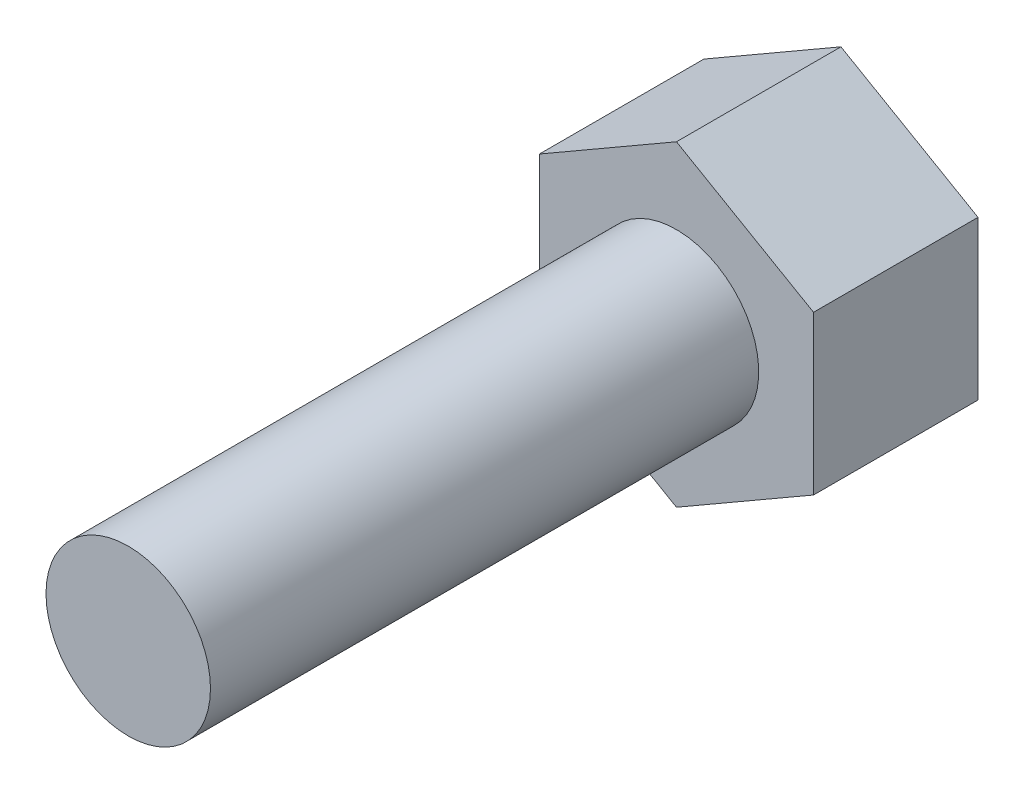
ISO-10303-21;
HEADER;
FILE_DESCRIPTION(('STEP AP214'),'2;1');
FILE_NAME('part.step','',(''),(''),'','','');
FILE_SCHEMA(('AUTOMOTIVE_DESIGN { 1 0 10303 214 1 1 1 1 }'));
ENDSEC;
DATA;
#1=APPLICATION_CONTEXT('core data for automotive mechanical design processes');
#2=APPLICATION_PROTOCOL_DEFINITION('international standard','automotive_design',2000,#1);
#3=PRODUCT_CONTEXT('',#1,'mechanical');
#4=PRODUCT('Part','Part','',(#3));
#5=PRODUCT_RELATED_PRODUCT_CATEGORY('part','',(#4));
#6=PRODUCT_DEFINITION_FORMATION('','',#4);
#7=PRODUCT_DEFINITION_CONTEXT('part definition',#1,'design');
#8=PRODUCT_DEFINITION('design','',#6,#7);
#9=PRODUCT_DEFINITION_SHAPE('','',#8);
#10=(LENGTH_UNIT() NAMED_UNIT(*) SI_UNIT(.MILLI.,.METRE.));
#11=(NAMED_UNIT(*) PLANE_ANGLE_UNIT() SI_UNIT($,.RADIAN.));
#12=(NAMED_UNIT(*) SI_UNIT($,.STERADIAN.) SOLID_ANGLE_UNIT());
#13=UNCERTAINTY_MEASURE_WITH_UNIT(LENGTH_MEASURE(1.E-05),#10,'distance_accuracy_value','');
#14=(GEOMETRIC_REPRESENTATION_CONTEXT(3) GLOBAL_UNCERTAINTY_ASSIGNED_CONTEXT((#13)) GLOBAL_UNIT_ASSIGNED_CONTEXT((#10,
#11,#12)) REPRESENTATION_CONTEXT('',''));
#15=CARTESIAN_POINT('',(0.,0.,0.));
#16=DIRECTION('',(0.,0.,1.));
#17=DIRECTION('',(1.,0.,0.));
#18=AXIS2_PLACEMENT_3D('',#15,#16,#17);
#19=CARTESIAN_POINT('',(-63.4947615904966,14.9787081339713,10.));
#20=DIRECTION('',(0.,0.,-1.));
#21=DIRECTION('',(-1.,0.,0.));
#22=AXIS2_PLACEMENT_3D('',#19,#20,#21);
#23=CYLINDRICAL_SURFACE('',#22,1.5);
#24=CARTESIAN_POINT('',(-63.4947615904966,14.9787081339713,10.));
#25=DIRECTION('',(0.,0.,1.));
#26=DIRECTION('',(1.,0.,0.));
#27=AXIS2_PLACEMENT_3D('',#24,#25,#26);
#28=CIRCLE('',#27,1.5);
#29=CARTESIAN_POINT('',(-61.9947615904966,14.9787081339713,10.));
#30=VERTEX_POINT('',#29);
#31=EDGE_CURVE('E11',#30,#30,#28,.T.);
#32=ORIENTED_EDGE('',*,*,#31,.F.);
#33=EDGE_LOOP('',(#32));
#34=FACE_BOUND('',#33,.T.);
#35=CARTESIAN_POINT('',(-63.4947615904966,14.9787081339713,0.));
#36=DIRECTION('',(0.,0.,-1.));
#37=DIRECTION('',(-1.,0.,0.));
#38=AXIS2_PLACEMENT_3D('',#35,#36,#37);
#39=CIRCLE('',#38,1.5);
#40=CARTESIAN_POINT('',(-64.9947615904966,14.9787081339713,0.));
#41=VERTEX_POINT('',#40);
#42=EDGE_CURVE('E41',#41,#41,#39,.T.);
#43=ORIENTED_EDGE('',*,*,#42,.F.);
#44=EDGE_LOOP('',(#43));
#45=FACE_BOUND('',#44,.T.);
#46=ADVANCED_FACE('F33',(#34,#45),#23,.T.);
#47=CARTESIAN_POINT('',(-63.4947615904966,14.9787081339713,10.));
#48=DIRECTION('',(0.,0.,1.));
#49=DIRECTION('',(1.,0.,0.));
#50=AXIS2_PLACEMENT_3D('',#47,#48,#49);
#51=PLANE('',#50);
#52=ORIENTED_EDGE('',*,*,#31,.T.);
#53=EDGE_LOOP('',(#52));
#54=FACE_BOUND('',#53,.T.);
#55=ADVANCED_FACE('F143',(#54),#51,.T.);
#56=CARTESIAN_POINT('',(-60.9947615904966,13.5353324609972,-3.));
#57=DIRECTION('',(-0.5,0.866025403784439,0.));
#58=DIRECTION('',(-0.866025403784439,-0.5,0.));
#59=AXIS2_PLACEMENT_3D('',#56,#57,#58);
#60=PLANE('',#59);
#61=DIRECTION('',(-0.866025403784439,-0.5,0.));
#62=VECTOR('',#61,1.);
#63=CARTESIAN_POINT('',(-60.9947615904966,13.5353324609972,0.));
#64=LINE('',#63,#62);
#65=CARTESIAN_POINT('',(-60.9947615904966,13.5353324609972,0.));
#66=VERTEX_POINT('',#65);
#67=CARTESIAN_POINT('',(-63.4947615904967,12.0919567880232,0.));
#68=VERTEX_POINT('',#67);
#69=EDGE_CURVE('E118',#66,#68,#64,.T.);
#70=ORIENTED_EDGE('',*,*,#69,.T.);
#71=DIRECTION('',(0.,0.,1.));
#72=VECTOR('',#71,1.);
#73=CARTESIAN_POINT('',(-63.4947615904967,12.0919567880232,-3.));
#74=LINE('',#73,#72);
#75=CARTESIAN_POINT('',(-63.4947615904967,12.0919567880232,-3.));
#76=VERTEX_POINT('',#75);
#77=EDGE_CURVE('E135',#76,#68,#74,.T.);
#78=ORIENTED_EDGE('',*,*,#77,.F.);
#79=DIRECTION('',(-0.866025403784439,-0.5,0.));
#80=VECTOR('',#79,1.);
#81=CARTESIAN_POINT('',(-60.9947615904966,13.5353324609972,-3.));
#82=LINE('',#81,#80);
#83=CARTESIAN_POINT('',(-60.9947615904966,13.5353324609972,-3.));
#84=VERTEX_POINT('',#83);
#85=EDGE_CURVE('E128',#84,#76,#82,.T.);
#86=ORIENTED_EDGE('',*,*,#85,.F.);
#87=DIRECTION('',(0.,0.,1.));
#88=VECTOR('',#87,1.);
#89=CARTESIAN_POINT('',(-60.9947615904966,13.5353324609972,-3.));
#90=LINE('',#89,#88);
#91=EDGE_CURVE('E114',#84,#66,#90,.T.);
#92=ORIENTED_EDGE('',*,*,#91,.T.);
#93=EDGE_LOOP('',(#70,#78,#86,#92));
#94=FACE_BOUND('',#93,.T.);
#95=ADVANCED_FACE('F148',(#94),#60,.F.);
#96=CARTESIAN_POINT('',(-63.4947615904967,12.0919567880232,-3.));
#97=DIRECTION('',(0.5,0.866025403784438,0.));
#98=DIRECTION('',(-0.866025403784438,0.5,0.));
#99=AXIS2_PLACEMENT_3D('',#96,#97,#98);
#100=PLANE('',#99);
#101=DIRECTION('',(-0.866025403784438,0.5,0.));
#102=VECTOR('',#101,1.);
#103=CARTESIAN_POINT('',(-63.4947615904967,12.0919567880232,0.));
#104=LINE('',#103,#102);
#105=CARTESIAN_POINT('',(-65.9947615904966,13.5353324609972,0.));
#106=VERTEX_POINT('',#105);
#107=EDGE_CURVE('E121',#68,#106,#104,.T.);
#108=ORIENTED_EDGE('',*,*,#107,.T.);
#109=DIRECTION('',(0.,0.,1.));
#110=VECTOR('',#109,1.);
#111=CARTESIAN_POINT('',(-65.9947615904966,13.5353324609972,-3.));
#112=LINE('',#111,#110);
#113=CARTESIAN_POINT('',(-65.9947615904966,13.5353324609972,-3.));
#114=VERTEX_POINT('',#113);
#115=EDGE_CURVE('E132',#114,#106,#112,.T.);
#116=ORIENTED_EDGE('',*,*,#115,.F.);
#117=DIRECTION('',(-0.866025403784438,0.5,0.));
#118=VECTOR('',#117,1.);
#119=CARTESIAN_POINT('',(-63.4947615904967,12.0919567880232,-3.));
#120=LINE('',#119,#118);
#121=EDGE_CURVE('E87',#76,#114,#120,.T.);
#122=ORIENTED_EDGE('',*,*,#121,.F.);
#123=ORIENTED_EDGE('',*,*,#77,.T.);
#124=EDGE_LOOP('',(#108,#116,#122,#123));
#125=FACE_BOUND('',#124,.T.);
#126=ADVANCED_FACE('F154',(#125),#100,.F.);
#127=CARTESIAN_POINT('',(-65.9947615904966,13.5353324609972,-3.));
#128=DIRECTION('',(1.,0.,0.));
#129=DIRECTION('',(0.,0.,-1.));
#130=AXIS2_PLACEMENT_3D('',#127,#128,#129);
#131=PLANE('',#130);
#132=DIRECTION('',(0.,1.,0.));
#133=VECTOR('',#132,1.);
#134=CARTESIAN_POINT('',(-65.9947615904966,13.5353324609972,0.));
#135=LINE('',#134,#133);
#136=CARTESIAN_POINT('',(-65.9947615904966,16.4220838069454,0.));
#137=VERTEX_POINT('',#136);
#138=EDGE_CURVE('E123',#106,#137,#135,.T.);
#139=ORIENTED_EDGE('',*,*,#138,.T.);
#140=DIRECTION('',(0.,0.,1.));
#141=VECTOR('',#140,1.);
#142=CARTESIAN_POINT('',(-65.9947615904966,16.4220838069454,-3.));
#143=LINE('',#142,#141);
#144=CARTESIAN_POINT('',(-65.9947615904966,16.4220838069454,-3.));
#145=VERTEX_POINT('',#144);
#146=EDGE_CURVE('E109',#145,#137,#143,.T.);
#147=ORIENTED_EDGE('',*,*,#146,.F.);
#148=DIRECTION('',(0.,1.,0.));
#149=VECTOR('',#148,1.);
#150=CARTESIAN_POINT('',(-65.9947615904966,13.5353324609972,-3.));
#151=LINE('',#150,#149);
#152=EDGE_CURVE('E100',#114,#145,#151,.T.);
#153=ORIENTED_EDGE('',*,*,#152,.F.);
#154=ORIENTED_EDGE('',*,*,#115,.T.);
#155=EDGE_LOOP('',(#139,#147,#153,#154));
#156=FACE_BOUND('',#155,.T.);
#157=ADVANCED_FACE('F160',(#156),#131,.F.);
#158=CARTESIAN_POINT('',(-65.9947615904966,16.4220838069454,-3.));
#159=DIRECTION('',(0.499999999999999,-0.866025403784439,0.));
#160=DIRECTION('',(0.866025403784439,0.499999999999999,0.));
#161=AXIS2_PLACEMENT_3D('',#158,#159,#160);
#162=PLANE('',#161);
#163=DIRECTION('',(0.866025403784439,0.499999999999999,0.));
#164=VECTOR('',#163,1.);
#165=CARTESIAN_POINT('',(-65.9947615904966,16.4220838069454,0.));
#166=LINE('',#165,#164);
#167=CARTESIAN_POINT('',(-63.4947615904966,17.8654594799194,0.));
#168=VERTEX_POINT('',#167);
#169=EDGE_CURVE('E108',#137,#168,#166,.T.);
#170=ORIENTED_EDGE('',*,*,#169,.T.);
#171=DIRECTION('',(0.,0.,1.));
#172=VECTOR('',#171,1.);
#173=CARTESIAN_POINT('',(-63.4947615904966,17.8654594799194,-3.));
#174=LINE('',#173,#172);
#175=CARTESIAN_POINT('',(-63.4947615904966,17.8654594799194,-3.));
#176=VERTEX_POINT('',#175);
#177=EDGE_CURVE('E105',#176,#168,#174,.T.);
#178=ORIENTED_EDGE('',*,*,#177,.F.);
#179=DIRECTION('',(0.866025403784439,0.499999999999999,0.));
#180=VECTOR('',#179,1.);
#181=CARTESIAN_POINT('',(-65.9947615904966,16.4220838069454,-3.));
#182=LINE('',#181,#180);
#183=EDGE_CURVE('E94',#145,#176,#182,.T.);
#184=ORIENTED_EDGE('',*,*,#183,.F.);
#185=ORIENTED_EDGE('',*,*,#146,.T.);
#186=EDGE_LOOP('',(#170,#178,#184,#185));
#187=FACE_BOUND('',#186,.T.);
#188=ADVANCED_FACE('F106',(#187),#162,.F.);
#189=CARTESIAN_POINT('',(-63.4947615904966,17.8654594799194,-3.));
#190=DIRECTION('',(-0.500000000000001,-0.866025403784438,0.));
#191=DIRECTION('',(0.866025403784438,-0.500000000000001,0.));
#192=AXIS2_PLACEMENT_3D('',#189,#190,#191);
#193=PLANE('',#192);
#194=DIRECTION('',(0.866025403784438,-0.500000000000001,0.));
#195=VECTOR('',#194,1.);
#196=CARTESIAN_POINT('',(-63.4947615904966,17.8654594799194,0.));
#197=LINE('',#196,#195);
#198=CARTESIAN_POINT('',(-60.9947615904966,16.4220838069454,0.));
#199=VERTEX_POINT('',#198);
#200=EDGE_CURVE('E72',#168,#199,#197,.T.);
#201=ORIENTED_EDGE('',*,*,#200,.T.);
#202=DIRECTION('',(0.,0.,1.));
#203=VECTOR('',#202,1.);
#204=CARTESIAN_POINT('',(-60.9947615904966,16.4220838069454,-3.));
#205=LINE('',#204,#203);
#206=CARTESIAN_POINT('',(-60.9947615904966,16.4220838069454,-3.));
#207=VERTEX_POINT('',#206);
#208=EDGE_CURVE('E110',#207,#199,#205,.T.);
#209=ORIENTED_EDGE('',*,*,#208,.F.);
#210=DIRECTION('',(0.866025403784438,-0.500000000000001,0.));
#211=VECTOR('',#210,1.);
#212=CARTESIAN_POINT('',(-63.4947615904966,17.8654594799194,-3.));
#213=LINE('',#212,#211);
#214=EDGE_CURVE('E98',#176,#207,#213,.T.);
#215=ORIENTED_EDGE('',*,*,#214,.F.);
#216=ORIENTED_EDGE('',*,*,#177,.T.);
#217=EDGE_LOOP('',(#201,#209,#215,#216));
#218=FACE_BOUND('',#217,.T.);
#219=ADVANCED_FACE('F112',(#218),#193,.F.);
#220=CARTESIAN_POINT('',(-60.9947615904966,16.4220838069454,-3.));
#221=DIRECTION('',(-1.,0.,0.));
#222=DIRECTION('',(0.,0.,1.));
#223=AXIS2_PLACEMENT_3D('',#220,#221,#222);
#224=PLANE('',#223);
#225=DIRECTION('',(0.,-1.,0.));
#226=VECTOR('',#225,1.);
#227=CARTESIAN_POINT('',(-60.9947615904966,16.4220838069454,0.));
#228=LINE('',#227,#226);
#229=EDGE_CURVE('E78',#199,#66,#228,.T.);
#230=ORIENTED_EDGE('',*,*,#229,.T.);
#231=ORIENTED_EDGE('',*,*,#91,.F.);
#232=DIRECTION('',(0.,-1.,0.));
#233=VECTOR('',#232,1.);
#234=CARTESIAN_POINT('',(-60.9947615904966,16.4220838069454,-3.));
#235=LINE('',#234,#233);
#236=EDGE_CURVE('E49',#207,#84,#235,.T.);
#237=ORIENTED_EDGE('',*,*,#236,.F.);
#238=ORIENTED_EDGE('',*,*,#208,.T.);
#239=EDGE_LOOP('',(#230,#231,#237,#238));
#240=FACE_BOUND('',#239,.T.);
#241=ADVANCED_FACE('F168',(#240),#224,.F.);
#242=CARTESIAN_POINT('',(0.,0.,-3.));
#243=DIRECTION('',(0.,0.,-1.));
#244=DIRECTION('',(-1.,0.,0.));
#245=AXIS2_PLACEMENT_3D('',#242,#243,#244);
#246=PLANE('',#245);
#247=ORIENTED_EDGE('',*,*,#85,.T.);
#248=ORIENTED_EDGE('',*,*,#121,.T.);
#249=ORIENTED_EDGE('',*,*,#152,.T.);
#250=ORIENTED_EDGE('',*,*,#183,.T.);
#251=ORIENTED_EDGE('',*,*,#214,.T.);
#252=ORIENTED_EDGE('',*,*,#236,.T.);
#253=EDGE_LOOP('',(#247,#248,#249,#250,#251,#252));
#254=FACE_BOUND('',#253,.T.);
#255=ADVANCED_FACE('F96',(#254),#246,.T.);
#256=CARTESIAN_POINT('',(0.,0.,0.));
#257=DIRECTION('',(0.,0.,-1.));
#258=DIRECTION('',(-1.,0.,0.));
#259=AXIS2_PLACEMENT_3D('',#256,#257,#258);
#260=PLANE('',#259);
#261=ORIENTED_EDGE('',*,*,#42,.T.);
#262=EDGE_LOOP('',(#261));
#263=FACE_BOUND('',#262,.T.);
#264=ORIENTED_EDGE('',*,*,#69,.F.);
#265=ORIENTED_EDGE('',*,*,#229,.F.);
#266=ORIENTED_EDGE('',*,*,#200,.F.);
#267=ORIENTED_EDGE('',*,*,#169,.F.);
#268=ORIENTED_EDGE('',*,*,#138,.F.);
#269=ORIENTED_EDGE('',*,*,#107,.F.);
#270=EDGE_LOOP('',(#264,#265,#266,#267,#268,#269));
#271=FACE_BOUND('',#270,.T.);
#272=ADVANCED_FACE('F139',(#263,#271),#260,.F.);
#273=CLOSED_SHELL('',(#46,#55,#95,#126,#157,#188,#219,#241,#255,#272));
#274=MANIFOLD_SOLID_BREP('B2',#273);
#275=ADVANCED_BREP_SHAPE_REPRESENTATION('',(#18,#274),#14);
#276=SHAPE_DEFINITION_REPRESENTATION(#9,#275);
ENDSEC;
END-ISO-10303-21;
